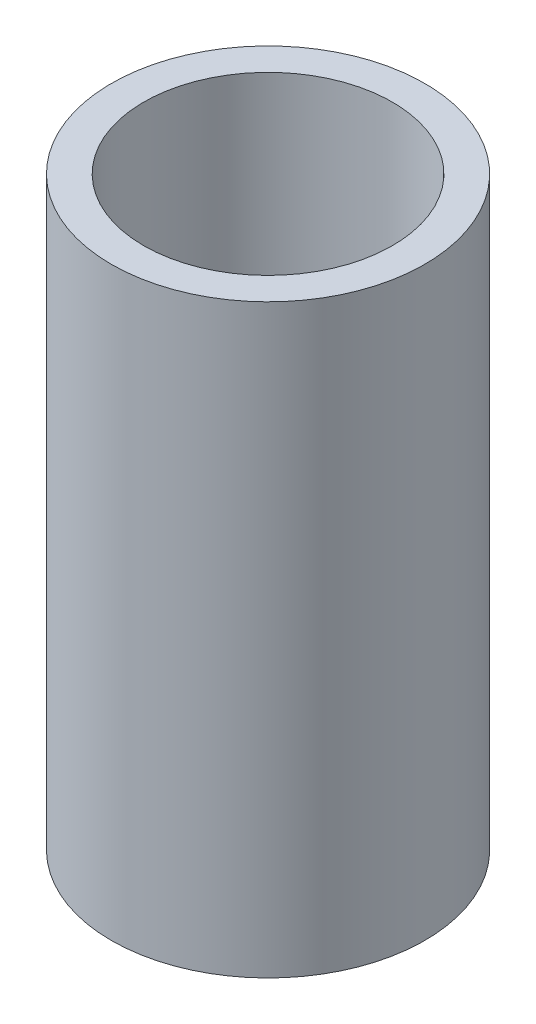
ISO-10303-21;
HEADER;
FILE_DESCRIPTION(('STEP AP214'),'2;1');
FILE_NAME('part.step','',(''),(''),'','','');
FILE_SCHEMA(('AUTOMOTIVE_DESIGN { 1 0 10303 214 1 1 1 1 }'));
ENDSEC;
DATA;
#1=APPLICATION_CONTEXT('core data for automotive mechanical design processes');
#2=APPLICATION_PROTOCOL_DEFINITION('international standard','automotive_design',2000,#1);
#3=PRODUCT_CONTEXT('',#1,'mechanical');
#4=PRODUCT('Part','Part','',(#3));
#5=PRODUCT_RELATED_PRODUCT_CATEGORY('part','',(#4));
#6=PRODUCT_DEFINITION_FORMATION('','',#4);
#7=PRODUCT_DEFINITION_CONTEXT('part definition',#1,'design');
#8=PRODUCT_DEFINITION('design','',#6,#7);
#9=PRODUCT_DEFINITION_SHAPE('','',#8);
#10=(LENGTH_UNIT() NAMED_UNIT(*) SI_UNIT(.MILLI.,.METRE.));
#11=(NAMED_UNIT(*) PLANE_ANGLE_UNIT() SI_UNIT($,.RADIAN.));
#12=(NAMED_UNIT(*) SI_UNIT($,.STERADIAN.) SOLID_ANGLE_UNIT());
#13=UNCERTAINTY_MEASURE_WITH_UNIT(LENGTH_MEASURE(1.E-05),#10,'distance_accuracy_value','');
#14=(GEOMETRIC_REPRESENTATION_CONTEXT(3) GLOBAL_UNCERTAINTY_ASSIGNED_CONTEXT((#13)) GLOBAL_UNIT_ASSIGNED_CONTEXT((#10,
#11,#12)) REPRESENTATION_CONTEXT('',''));
#15=CARTESIAN_POINT('',(0.,0.,0.));
#16=DIRECTION('',(0.,0.,1.));
#17=DIRECTION('',(1.,0.,0.));
#18=AXIS2_PLACEMENT_3D('',#15,#16,#17);
#19=CARTESIAN_POINT('',(0.,14.948000124,0.));
#20=DIRECTION('',(0.,1.,0.));
#21=DIRECTION('',(0.,0.,1.));
#22=AXIS2_PLACEMENT_3D('',#19,#20,#21);
#23=PLANE('',#22);
#24=CARTESIAN_POINT('',(0.,14.948000124,0.));
#25=DIRECTION('',(0.,1.,0.));
#26=DIRECTION('',(0.,0.,1.));
#27=AXIS2_PLACEMENT_3D('',#24,#25,#26);
#28=CIRCLE('',#27,4.);
#29=CARTESIAN_POINT('',(0.,14.948000124,4.));
#30=VERTEX_POINT('',#29);
#31=EDGE_CURVE('E10',#30,#30,#28,.T.);
#32=ORIENTED_EDGE('',*,*,#31,.T.);
#33=EDGE_LOOP('',(#32));
#34=FACE_BOUND('',#33,.T.);
#35=CARTESIAN_POINT('',(0.,14.948000124,0.));
#36=DIRECTION('',(0.,1.,0.));
#37=DIRECTION('',(0.,0.,1.));
#38=AXIS2_PLACEMENT_3D('',#35,#36,#37);
#39=CIRCLE('',#38,3.175);
#40=CARTESIAN_POINT('',(0.,14.948000124,3.175));
#41=VERTEX_POINT('',#40);
#42=EDGE_CURVE('E50',#41,#41,#39,.T.);
#43=ORIENTED_EDGE('',*,*,#42,.F.);
#44=EDGE_LOOP('',(#43));
#45=FACE_BOUND('',#44,.T.);
#46=ADVANCED_FACE('F37',(#34,#45),#23,.T.);
#47=CARTESIAN_POINT('',(0.,0.,0.));
#48=DIRECTION('',(0.,1.,0.));
#49=DIRECTION('',(0.,0.,1.));
#50=AXIS2_PLACEMENT_3D('',#47,#48,#49);
#51=PLANE('',#50);
#52=CARTESIAN_POINT('',(0.,0.,0.));
#53=DIRECTION('',(0.,1.,0.));
#54=DIRECTION('',(0.,0.,1.));
#55=AXIS2_PLACEMENT_3D('',#52,#53,#54);
#56=CIRCLE('',#55,4.);
#57=CARTESIAN_POINT('',(0.,0.,4.));
#58=VERTEX_POINT('',#57);
#59=EDGE_CURVE('E41',#58,#58,#56,.T.);
#60=ORIENTED_EDGE('',*,*,#59,.F.);
#61=EDGE_LOOP('',(#60));
#62=FACE_BOUND('',#61,.T.);
#63=CARTESIAN_POINT('',(0.,0.,0.));
#64=DIRECTION('',(0.,1.,0.));
#65=DIRECTION('',(0.,0.,1.));
#66=AXIS2_PLACEMENT_3D('',#63,#64,#65);
#67=CIRCLE('',#66,3.175);
#68=CARTESIAN_POINT('',(0.,0.,3.175));
#69=VERTEX_POINT('',#68);
#70=EDGE_CURVE('E52',#69,#69,#67,.T.);
#71=ORIENTED_EDGE('',*,*,#70,.T.);
#72=EDGE_LOOP('',(#71));
#73=FACE_BOUND('',#72,.T.);
#74=ADVANCED_FACE('F64',(#62,#73),#51,.F.);
#75=CARTESIAN_POINT('',(0.,14.948000124,0.));
#76=DIRECTION('',(0.,-1.,0.));
#77=DIRECTION('',(0.,0.,-1.));
#78=AXIS2_PLACEMENT_3D('',#75,#76,#77);
#79=CYLINDRICAL_SURFACE('',#78,4.);
#80=ORIENTED_EDGE('',*,*,#31,.F.);
#81=EDGE_LOOP('',(#80));
#82=FACE_BOUND('',#81,.T.);
#83=ORIENTED_EDGE('',*,*,#59,.T.);
#84=EDGE_LOOP('',(#83));
#85=FACE_BOUND('',#84,.T.);
#86=ADVANCED_FACE('F39',(#82,#85),#79,.T.);
#87=CARTESIAN_POINT('',(0.,14.948000124,0.));
#88=DIRECTION('',(0.,-1.,0.));
#89=DIRECTION('',(0.,0.,-1.));
#90=AXIS2_PLACEMENT_3D('',#87,#88,#89);
#91=CYLINDRICAL_SURFACE('',#90,3.175);
#92=ORIENTED_EDGE('',*,*,#42,.T.);
#93=EDGE_LOOP('',(#92));
#94=FACE_BOUND('',#93,.T.);
#95=ORIENTED_EDGE('',*,*,#70,.F.);
#96=EDGE_LOOP('',(#95));
#97=FACE_BOUND('',#96,.T.);
#98=ADVANCED_FACE('F60',(#94,#97),#91,.F.);
#99=CLOSED_SHELL('',(#46,#74,#86,#98));
#100=MANIFOLD_SOLID_BREP('B2',#99);
#101=ADVANCED_BREP_SHAPE_REPRESENTATION('',(#18,#100),#14);
#102=SHAPE_DEFINITION_REPRESENTATION(#9,#101);
ENDSEC;
END-ISO-10303-21;
